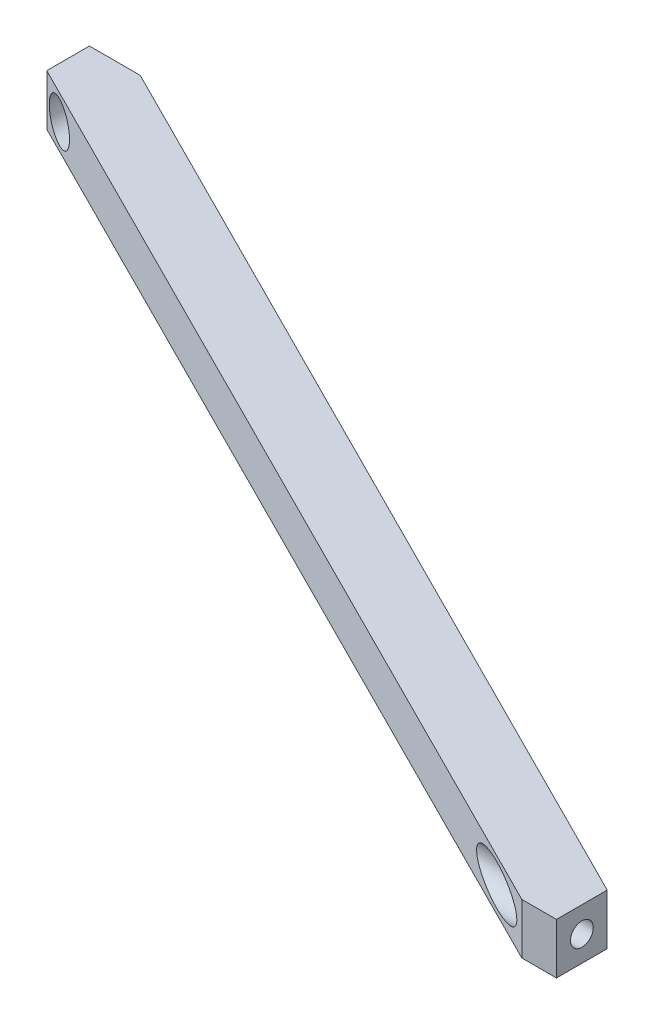
ISO-10303-21;
HEADER;
FILE_DESCRIPTION(('STEP AP214'),'2;1');
FILE_NAME('part.step','',(''),(''),'','','');
FILE_SCHEMA(('AUTOMOTIVE_DESIGN { 1 0 10303 214 1 1 1 1 }'));
ENDSEC;
DATA;
#1=APPLICATION_CONTEXT('core data for automotive mechanical design processes');
#2=APPLICATION_PROTOCOL_DEFINITION('international standard','automotive_design',2000,#1);
#3=PRODUCT_CONTEXT('',#1,'mechanical');
#4=PRODUCT('Part','Part','',(#3));
#5=PRODUCT_RELATED_PRODUCT_CATEGORY('part','',(#4));
#6=PRODUCT_DEFINITION_FORMATION('','',#4);
#7=PRODUCT_DEFINITION_CONTEXT('part definition',#1,'design');
#8=PRODUCT_DEFINITION('design','',#6,#7);
#9=PRODUCT_DEFINITION_SHAPE('','',#8);
#10=(LENGTH_UNIT() NAMED_UNIT(*) SI_UNIT(.MILLI.,.METRE.));
#11=(NAMED_UNIT(*) PLANE_ANGLE_UNIT() SI_UNIT($,.RADIAN.));
#12=(NAMED_UNIT(*) SI_UNIT($,.STERADIAN.) SOLID_ANGLE_UNIT());
#13=UNCERTAINTY_MEASURE_WITH_UNIT(LENGTH_MEASURE(1.E-05),#10,'distance_accuracy_value','');
#14=(GEOMETRIC_REPRESENTATION_CONTEXT(3) GLOBAL_UNCERTAINTY_ASSIGNED_CONTEXT((#13)) GLOBAL_UNIT_ASSIGNED_CONTEXT((#10,
#11,#12)) REPRESENTATION_CONTEXT('',''));
#15=CARTESIAN_POINT('',(0.,0.,0.));
#16=DIRECTION('',(0.,0.,1.));
#17=DIRECTION('',(1.,0.,0.));
#18=AXIS2_PLACEMENT_3D('',#15,#16,#17);
#19=CARTESIAN_POINT('',(-40.,10.,115.));
#20=DIRECTION('',(-1.,0.,0.));
#21=DIRECTION('',(0.,0.,1.));
#22=AXIS2_PLACEMENT_3D('',#19,#20,#21);
#23=PLANE('',#22);
#24=DIRECTION('',(0.,0.,-1.));
#25=VECTOR('',#24,1.);
#26=CARTESIAN_POINT('',(-40.,0.,115.));
#27=LINE('',#26,#25);
#28=CARTESIAN_POINT('',(-40.,0.,125.));
#29=VERTEX_POINT('',#28);
#30=CARTESIAN_POINT('',(-40.,0.,115.));
#31=VERTEX_POINT('',#30);
#32=EDGE_CURVE('E93',#29,#31,#27,.T.);
#33=ORIENTED_EDGE('',*,*,#32,.T.);
#34=DIRECTION('',(0.,-1.,0.));
#35=VECTOR('',#34,1.);
#36=CARTESIAN_POINT('',(-40.,10.,115.));
#37=LINE('',#36,#35);
#38=CARTESIAN_POINT('',(-40.,10.,115.));
#39=VERTEX_POINT('',#38);
#40=EDGE_CURVE('E130',#39,#31,#37,.T.);
#41=ORIENTED_EDGE('',*,*,#40,.F.);
#42=DIRECTION('',(0.,0.,-1.));
#43=VECTOR('',#42,1.);
#44=CARTESIAN_POINT('',(-40.,10.,115.));
#45=LINE('',#44,#43);
#46=CARTESIAN_POINT('',(-40.,10.,125.));
#47=VERTEX_POINT('',#46);
#48=EDGE_CURVE('E118',#47,#39,#45,.T.);
#49=ORIENTED_EDGE('',*,*,#48,.F.);
#50=DIRECTION('',(0.,-1.,0.));
#51=VECTOR('',#50,1.);
#52=CARTESIAN_POINT('',(-40.,10.,125.));
#53=LINE('',#52,#51);
#54=EDGE_CURVE('E125',#47,#29,#53,.T.);
#55=ORIENTED_EDGE('',*,*,#54,.T.);
#56=EDGE_LOOP('',(#33,#41,#49,#55));
#57=FACE_BOUND('',#56,.T.);
#58=CARTESIAN_POINT('',(-40.,5.,120.));
#59=DIRECTION('',(1.,0.,0.));
#60=DIRECTION('',(0.,0.,-1.));
#61=AXIS2_PLACEMENT_3D('',#58,#59,#60);
#62=CIRCLE('',#61,2.24999999999999);
#63=CARTESIAN_POINT('',(-40.,5.,117.75));
#64=VERTEX_POINT('',#63);
#65=EDGE_CURVE('E161',#64,#64,#62,.T.);
#66=ORIENTED_EDGE('',*,*,#65,.F.);
#67=EDGE_LOOP('',(#66));
#68=FACE_BOUND('',#67,.T.);
#69=ADVANCED_FACE('F51',(#57,#68),#23,.F.);
#70=CARTESIAN_POINT('',(-235.,10.,22.));
#71=DIRECTION('',(0.,0.,1.));
#72=DIRECTION('',(1.,0.,0.));
#73=AXIS2_PLACEMENT_3D('',#70,#71,#72);
#74=PLANE('',#73);
#75=CARTESIAN_POINT('',(-230.,5.,22.));
#76=DIRECTION('',(0.,0.,-1.));
#77=DIRECTION('',(-1.,0.,0.));
#78=AXIS2_PLACEMENT_3D('',#75,#76,#77);
#79=CIRCLE('',#78,2.09999999999999);
#80=CARTESIAN_POINT('',(-232.1,5.,22.));
#81=VERTEX_POINT('',#80);
#82=EDGE_CURVE('E142',#81,#81,#79,.T.);
#83=ORIENTED_EDGE('',*,*,#82,.F.);
#84=EDGE_LOOP('',(#83));
#85=FACE_BOUND('',#84,.T.);
#86=DIRECTION('',(-1.,0.,0.));
#87=VECTOR('',#86,1.);
#88=CARTESIAN_POINT('',(-235.,0.,22.));
#89=LINE('',#88,#87);
#90=CARTESIAN_POINT('',(-225.,0.,22.));
#91=VERTEX_POINT('',#90);
#92=CARTESIAN_POINT('',(-235.,0.,22.));
#93=VERTEX_POINT('',#92);
#94=EDGE_CURVE('E138',#91,#93,#89,.T.);
#95=ORIENTED_EDGE('',*,*,#94,.T.);
#96=DIRECTION('',(0.,-1.,0.));
#97=VECTOR('',#96,1.);
#98=CARTESIAN_POINT('',(-235.,10.,22.));
#99=LINE('',#98,#97);
#100=CARTESIAN_POINT('',(-235.,10.,22.));
#101=VERTEX_POINT('',#100);
#102=EDGE_CURVE('E13',#101,#93,#99,.T.);
#103=ORIENTED_EDGE('',*,*,#102,.F.);
#104=DIRECTION('',(-1.,0.,0.));
#105=VECTOR('',#104,1.);
#106=CARTESIAN_POINT('',(-235.,10.,22.));
#107=LINE('',#106,#105);
#108=CARTESIAN_POINT('',(-225.,10.,22.));
#109=VERTEX_POINT('',#108);
#110=EDGE_CURVE('E149',#109,#101,#107,.T.);
#111=ORIENTED_EDGE('',*,*,#110,.F.);
#112=DIRECTION('',(0.,-1.,0.));
#113=VECTOR('',#112,1.);
#114=CARTESIAN_POINT('',(-225.,10.,22.));
#115=LINE('',#114,#113);
#116=EDGE_CURVE('E134',#109,#91,#115,.T.);
#117=ORIENTED_EDGE('',*,*,#116,.T.);
#118=EDGE_LOOP('',(#95,#103,#111,#117));
#119=FACE_BOUND('',#118,.T.);
#120=ADVANCED_FACE('F53',(#85,#119),#74,.F.);
#121=CARTESIAN_POINT('',(-235.,10.,22.));
#122=DIRECTION('',(1.,0.,0.));
#123=DIRECTION('',(0.,0.,-1.));
#124=AXIS2_PLACEMENT_3D('',#121,#122,#123);
#125=PLANE('',#124);
#126=DIRECTION('',(0.,0.,1.));
#127=VECTOR('',#126,1.);
#128=CARTESIAN_POINT('',(-235.,0.,22.));
#129=LINE('',#128,#127);
#130=CARTESIAN_POINT('',(-235.,0.,30.4039163892734));
#131=VERTEX_POINT('',#130);
#132=EDGE_CURVE('E141',#93,#131,#129,.T.);
#133=ORIENTED_EDGE('',*,*,#132,.T.);
#134=DIRECTION('',(0.,-1.,0.));
#135=VECTOR('',#134,1.);
#136=CARTESIAN_POINT('',(-235.,10.,30.4039163892734));
#137=LINE('',#136,#135);
#138=CARTESIAN_POINT('',(-235.,10.,30.4039163892734));
#139=VERTEX_POINT('',#138);
#140=EDGE_CURVE('E61',#139,#131,#137,.T.);
#141=ORIENTED_EDGE('',*,*,#140,.F.);
#142=DIRECTION('',(0.,0.,1.));
#143=VECTOR('',#142,1.);
#144=CARTESIAN_POINT('',(-235.,10.,22.));
#145=LINE('',#144,#143);
#146=EDGE_CURVE('E107',#101,#139,#145,.T.);
#147=ORIENTED_EDGE('',*,*,#146,.F.);
#148=ORIENTED_EDGE('',*,*,#102,.T.);
#149=EDGE_LOOP('',(#133,#141,#147,#148));
#150=FACE_BOUND('',#149,.T.);
#151=ADVANCED_FACE('F182',(#150),#125,.F.);
#152=CARTESIAN_POINT('',(-235.,10.,30.4039163892734));
#153=DIRECTION('',(0.449144356092753,0.,-0.893459202980207));
#154=DIRECTION('',(-0.893459202980207,0.,-0.449144356092753));
#155=AXIS2_PLACEMENT_3D('',#152,#153,#154);
#156=PLANE('',#155);
#157=CARTESIAN_POINT('',(-56.7712315270492,5.,120.));
#158=DIRECTION('',(0.449144356092753,0.,-0.893459202980207));
#159=DIRECTION('',(0.893459202980207,0.,0.449144356092753));
#160=AXIS2_PLACEMENT_3D('',#157,#158,#159);
#161=ELLIPSE('',#160,8.90582269539633,4.00000000000001);
#162=CARTESIAN_POINT('',(-48.8142422797373,5.,124.));
#163=VERTEX_POINT('',#162);
#164=EDGE_CURVE('E55',#163,#163,#161,.T.);
#165=ORIENTED_EDGE('',*,*,#164,.T.);
#166=EDGE_LOOP('',(#165));
#167=FACE_BOUND('',#166,.T.);
#168=CARTESIAN_POINT('',(-230.,5.,32.9174299027869));
#169=DIRECTION('',(0.449144356092753,0.,-0.893459202980207));
#170=DIRECTION('',(-0.893459202980207,0.,-0.449144356092753));
#171=AXIS2_PLACEMENT_3D('',#168,#169,#170);
#172=ELLIPSE('',#171,4.47698113876679,3.99999999999999);
#173=CARTESIAN_POINT('',(-234.,5.,30.9066190919761));
#174=VERTEX_POINT('',#173);
#175=EDGE_CURVE('E158',#174,#174,#172,.T.);
#176=ORIENTED_EDGE('',*,*,#175,.T.);
#177=EDGE_LOOP('',(#176));
#178=FACE_BOUND('',#177,.T.);
#179=DIRECTION('',(0.893459202980207,0.,0.449144356092753));
#180=VECTOR('',#179,1.);
#181=CARTESIAN_POINT('',(-235.,0.,30.4039163892734));
#182=LINE('',#181,#180);
#183=CARTESIAN_POINT('',(-46.8249949679093,0.,125.));
#184=VERTEX_POINT('',#183);
#185=EDGE_CURVE('E144',#131,#184,#182,.T.);
#186=ORIENTED_EDGE('',*,*,#185,.T.);
#187=DIRECTION('',(0.,-1.,0.));
#188=VECTOR('',#187,1.);
#189=CARTESIAN_POINT('',(-46.8249949679093,10.,125.));
#190=LINE('',#189,#188);
#191=CARTESIAN_POINT('',(-46.8249949679093,10.,125.));
#192=VERTEX_POINT('',#191);
#193=EDGE_CURVE('E129',#192,#184,#190,.T.);
#194=ORIENTED_EDGE('',*,*,#193,.F.);
#195=DIRECTION('',(0.893459202980207,0.,0.449144356092753));
#196=VECTOR('',#195,1.);
#197=CARTESIAN_POINT('',(-235.,10.,30.4039163892734));
#198=LINE('',#197,#196);
#199=EDGE_CURVE('E120',#139,#192,#198,.T.);
#200=ORIENTED_EDGE('',*,*,#199,.F.);
#201=ORIENTED_EDGE('',*,*,#140,.T.);
#202=EDGE_LOOP('',(#186,#194,#200,#201));
#203=FACE_BOUND('',#202,.T.);
#204=ADVANCED_FACE('F185',(#167,#178,#203),#156,.F.);
#205=CARTESIAN_POINT('',(-46.8249949679093,10.,125.));
#206=DIRECTION('',(0.,0.,-1.));
#207=DIRECTION('',(-1.,0.,0.));
#208=AXIS2_PLACEMENT_3D('',#205,#206,#207);
#209=PLANE('',#208);
#210=DIRECTION('',(1.,0.,0.));
#211=VECTOR('',#210,1.);
#212=CARTESIAN_POINT('',(-46.8249949679093,0.,125.));
#213=LINE('',#212,#211);
#214=EDGE_CURVE('E128',#184,#29,#213,.T.);
#215=ORIENTED_EDGE('',*,*,#214,.T.);
#216=ORIENTED_EDGE('',*,*,#54,.F.);
#217=DIRECTION('',(1.,0.,0.));
#218=VECTOR('',#217,1.);
#219=CARTESIAN_POINT('',(-46.8249949679093,10.,125.));
#220=LINE('',#219,#218);
#221=EDGE_CURVE('E114',#192,#47,#220,.T.);
#222=ORIENTED_EDGE('',*,*,#221,.F.);
#223=ORIENTED_EDGE('',*,*,#193,.T.);
#224=EDGE_LOOP('',(#215,#216,#222,#223));
#225=FACE_BOUND('',#224,.T.);
#226=ADVANCED_FACE('F126',(#225),#209,.F.);
#227=CARTESIAN_POINT('',(-225.,10.,22.));
#228=DIRECTION('',(-0.449144356092753,0.,0.893459202980207));
#229=DIRECTION('',(0.893459202980207,0.,0.449144356092753));
#230=AXIS2_PLACEMENT_3D('',#227,#228,#229);
#231=PLANE('',#230);
#232=DIRECTION('',(-0.893459202980207,0.,-0.449144356092753));
#233=VECTOR('',#232,1.);
#234=CARTESIAN_POINT('',(-225.,0.,22.));
#235=LINE('',#234,#233);
#236=EDGE_CURVE('E99',#31,#91,#235,.T.);
#237=ORIENTED_EDGE('',*,*,#236,.T.);
#238=ORIENTED_EDGE('',*,*,#116,.F.);
#239=DIRECTION('',(-0.893459202980207,0.,-0.449144356092753));
#240=VECTOR('',#239,1.);
#241=CARTESIAN_POINT('',(-225.,10.,22.));
#242=LINE('',#241,#240);
#243=EDGE_CURVE('E70',#39,#109,#242,.T.);
#244=ORIENTED_EDGE('',*,*,#243,.F.);
#245=ORIENTED_EDGE('',*,*,#40,.T.);
#246=EDGE_LOOP('',(#237,#238,#244,#245));
#247=FACE_BOUND('',#246,.T.);
#248=ADVANCED_FACE('F190',(#247),#231,.F.);
#249=CARTESIAN_POINT('',(-40.,10.,22.0000000000001));
#250=DIRECTION('',(0.,-1.,0.));
#251=DIRECTION('',(0.,0.,-1.));
#252=AXIS2_PLACEMENT_3D('',#249,#250,#251);
#253=PLANE('',#252);
#254=ORIENTED_EDGE('',*,*,#110,.T.);
#255=ORIENTED_EDGE('',*,*,#146,.T.);
#256=ORIENTED_EDGE('',*,*,#199,.T.);
#257=ORIENTED_EDGE('',*,*,#221,.T.);
#258=ORIENTED_EDGE('',*,*,#48,.T.);
#259=ORIENTED_EDGE('',*,*,#243,.T.);
#260=EDGE_LOOP('',(#254,#255,#256,#257,#258,#259));
#261=FACE_BOUND('',#260,.T.);
#262=ADVANCED_FACE('F116',(#261),#253,.F.);
#263=CARTESIAN_POINT('',(-40.,0.,22.0000000000001));
#264=DIRECTION('',(0.,-1.,0.));
#265=DIRECTION('',(0.,0.,-1.));
#266=AXIS2_PLACEMENT_3D('',#263,#264,#265);
#267=PLANE('',#266);
#268=ORIENTED_EDGE('',*,*,#94,.F.);
#269=ORIENTED_EDGE('',*,*,#236,.F.);
#270=ORIENTED_EDGE('',*,*,#32,.F.);
#271=ORIENTED_EDGE('',*,*,#214,.F.);
#272=ORIENTED_EDGE('',*,*,#185,.F.);
#273=ORIENTED_EDGE('',*,*,#132,.F.);
#274=EDGE_LOOP('',(#268,#269,#270,#271,#272,#273));
#275=FACE_BOUND('',#274,.T.);
#276=ADVANCED_FACE('F188',(#275),#267,.T.);
#277=CARTESIAN_POINT('',(-230.,5.,125.));
#278=DIRECTION('',(0.,0.,-1.));
#279=DIRECTION('',(-1.,0.,0.));
#280=AXIS2_PLACEMENT_3D('',#277,#278,#279);
#281=CYLINDRICAL_SURFACE('',#280,2.09999999999999);
#282=CARTESIAN_POINT('',(-230.,5.,28.));
#283=DIRECTION('',(0.,0.,-1.));
#284=DIRECTION('',(-1.,0.,0.));
#285=AXIS2_PLACEMENT_3D('',#282,#283,#284);
#286=CIRCLE('',#285,2.09999999999999);
#287=CARTESIAN_POINT('',(-232.1,5.,28.));
#288=VERTEX_POINT('',#287);
#289=EDGE_CURVE('E155',#288,#288,#286,.F.);
#290=ORIENTED_EDGE('',*,*,#289,.T.);
#291=EDGE_LOOP('',(#290));
#292=FACE_BOUND('',#291,.T.);
#293=ORIENTED_EDGE('',*,*,#82,.T.);
#294=EDGE_LOOP('',(#293));
#295=FACE_BOUND('',#294,.T.);
#296=ADVANCED_FACE('F242',(#292,#295),#281,.F.);
#297=CARTESIAN_POINT('',(-40.,5.,120.));
#298=DIRECTION('',(1.,0.,0.));
#299=DIRECTION('',(0.,0.,-1.));
#300=AXIS2_PLACEMENT_3D('',#297,#298,#299);
#301=CYLINDRICAL_SURFACE('',#300,2.24999999999997);
#302=CARTESIAN_POINT('',(-46.,5.,120.));
#303=DIRECTION('',(1.,0.,0.));
#304=DIRECTION('',(0.,0.,-1.));
#305=AXIS2_PLACEMENT_3D('',#302,#303,#304);
#306=CIRCLE('',#305,2.24999999999997);
#307=CARTESIAN_POINT('',(-46.,5.,117.75));
#308=VERTEX_POINT('',#307);
#309=EDGE_CURVE('E162',#308,#308,#306,.F.);
#310=ORIENTED_EDGE('',*,*,#309,.T.);
#311=EDGE_LOOP('',(#310));
#312=FACE_BOUND('',#311,.T.);
#313=ORIENTED_EDGE('',*,*,#65,.T.);
#314=EDGE_LOOP('',(#313));
#315=FACE_BOUND('',#314,.T.);
#316=ADVANCED_FACE('F260',(#312,#315),#301,.F.);
#317=CARTESIAN_POINT('',(-230.,5.,40.));
#318=DIRECTION('',(0.,0.,-1.));
#319=DIRECTION('',(-1.,0.,0.));
#320=AXIS2_PLACEMENT_3D('',#317,#318,#319);
#321=CYLINDRICAL_SURFACE('',#320,3.99999999999999);
#322=CARTESIAN_POINT('',(-230.,5.,28.));
#323=DIRECTION('',(0.,0.,-1.));
#324=DIRECTION('',(-1.,0.,0.));
#325=AXIS2_PLACEMENT_3D('',#322,#323,#324);
#326=CIRCLE('',#325,3.99999999999999);
#327=CARTESIAN_POINT('',(-234.,5.,28.));
#328=VERTEX_POINT('',#327);
#329=EDGE_CURVE('E159',#328,#328,#326,.T.);
#330=ORIENTED_EDGE('',*,*,#329,.T.);
#331=EDGE_LOOP('',(#330));
#332=FACE_BOUND('',#331,.T.);
#333=ORIENTED_EDGE('',*,*,#175,.F.);
#334=EDGE_LOOP('',(#333));
#335=FACE_BOUND('',#334,.T.);
#336=ADVANCED_FACE('F267',(#332,#335),#321,.F.);
#337=CARTESIAN_POINT('',(-230.,5.,28.));
#338=DIRECTION('',(0.,0.,-1.));
#339=DIRECTION('',(-1.,0.,0.));
#340=AXIS2_PLACEMENT_3D('',#337,#338,#339);
#341=PLANE('',#340);
#342=ORIENTED_EDGE('',*,*,#329,.F.);
#343=EDGE_LOOP('',(#342));
#344=FACE_BOUND('',#343,.T.);
#345=ORIENTED_EDGE('',*,*,#289,.F.);
#346=EDGE_LOOP('',(#345));
#347=FACE_BOUND('',#346,.T.);
#348=ADVANCED_FACE('F271',(#344,#347),#341,.F.);
#349=CARTESIAN_POINT('',(-74.,5.,120.));
#350=DIRECTION('',(1.,0.,0.));
#351=DIRECTION('',(0.,0.,-1.));
#352=AXIS2_PLACEMENT_3D('',#349,#350,#351);
#353=CYLINDRICAL_SURFACE('',#352,4.00000000000001);
#354=CARTESIAN_POINT('',(-46.,5.,120.));
#355=DIRECTION('',(1.,0.,0.));
#356=DIRECTION('',(0.,0.,-1.));
#357=AXIS2_PLACEMENT_3D('',#354,#355,#356);
#358=CIRCLE('',#357,4.00000000000001);
#359=CARTESIAN_POINT('',(-46.,5.,116.));
#360=VERTEX_POINT('',#359);
#361=EDGE_CURVE('E164',#360,#360,#358,.T.);
#362=ORIENTED_EDGE('',*,*,#361,.T.);
#363=EDGE_LOOP('',(#362));
#364=FACE_BOUND('',#363,.T.);
#365=ORIENTED_EDGE('',*,*,#164,.F.);
#366=EDGE_LOOP('',(#365));
#367=FACE_BOUND('',#366,.T.);
#368=ADVANCED_FACE('F280',(#364,#367),#353,.F.);
#369=CARTESIAN_POINT('',(-46.,5.,120.));
#370=DIRECTION('',(1.,0.,0.));
#371=DIRECTION('',(0.,0.,-1.));
#372=AXIS2_PLACEMENT_3D('',#369,#370,#371);
#373=PLANE('',#372);
#374=ORIENTED_EDGE('',*,*,#361,.F.);
#375=EDGE_LOOP('',(#374));
#376=FACE_BOUND('',#375,.T.);
#377=ORIENTED_EDGE('',*,*,#309,.F.);
#378=EDGE_LOOP('',(#377));
#379=FACE_BOUND('',#378,.T.);
#380=ADVANCED_FACE('F291',(#376,#379),#373,.F.);
#381=CLOSED_SHELL('',(#69,#120,#151,#204,#226,#248,#262,#276,#296,#316,#336,#348,#368,#380));
#382=MANIFOLD_SOLID_BREP('B2',#381);
#383=ADVANCED_BREP_SHAPE_REPRESENTATION('',(#18,#382),#14);
#384=SHAPE_DEFINITION_REPRESENTATION(#9,#383);
ENDSEC;
END-ISO-10303-21;
